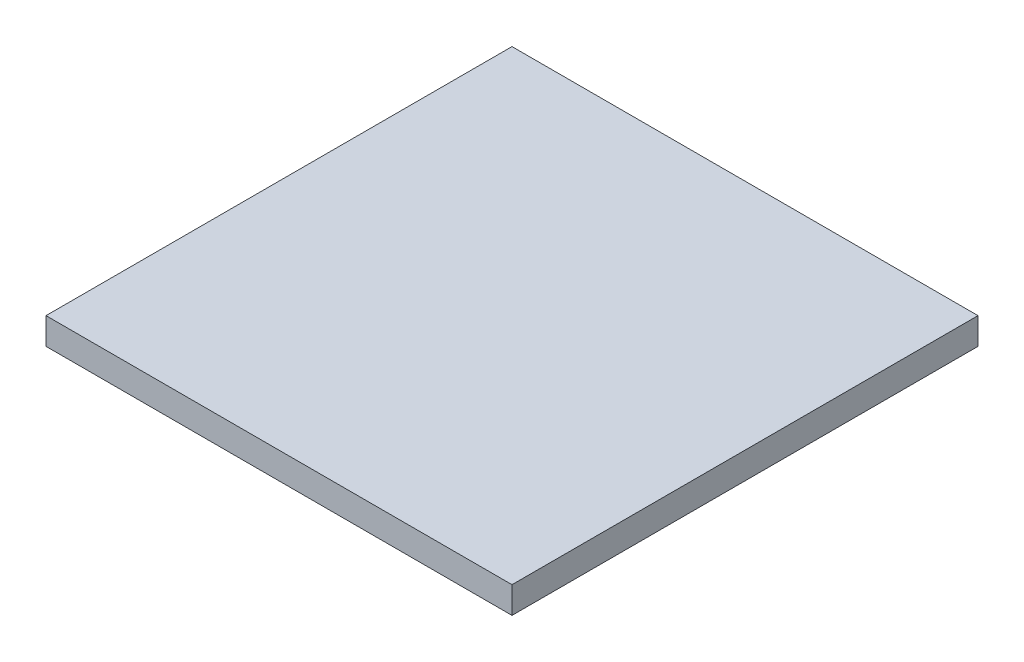
ISO-10303-21;
HEADER;
FILE_DESCRIPTION(('STEP AP214'),'2;1');
FILE_NAME('part.step','',(''),(''),'','','');
FILE_SCHEMA(('AUTOMOTIVE_DESIGN { 1 0 10303 214 1 1 1 1 }'));
ENDSEC;
DATA;
#1=APPLICATION_CONTEXT('core data for automotive mechanical design processes');
#2=APPLICATION_PROTOCOL_DEFINITION('international standard','automotive_design',2000,#1);
#3=PRODUCT_CONTEXT('',#1,'mechanical');
#4=PRODUCT('Part','Part','',(#3));
#5=PRODUCT_RELATED_PRODUCT_CATEGORY('part','',(#4));
#6=PRODUCT_DEFINITION_FORMATION('','',#4);
#7=PRODUCT_DEFINITION_CONTEXT('part definition',#1,'design');
#8=PRODUCT_DEFINITION('design','',#6,#7);
#9=PRODUCT_DEFINITION_SHAPE('','',#8);
#10=(LENGTH_UNIT() NAMED_UNIT(*) SI_UNIT(.MILLI.,.METRE.));
#11=(NAMED_UNIT(*) PLANE_ANGLE_UNIT() SI_UNIT($,.RADIAN.));
#12=(NAMED_UNIT(*) SI_UNIT($,.STERADIAN.) SOLID_ANGLE_UNIT());
#13=UNCERTAINTY_MEASURE_WITH_UNIT(LENGTH_MEASURE(1.E-05),#10,'distance_accuracy_value','');
#14=(GEOMETRIC_REPRESENTATION_CONTEXT(3) GLOBAL_UNCERTAINTY_ASSIGNED_CONTEXT((#13)) GLOBAL_UNIT_ASSIGNED_CONTEXT((#10,
#11,#12)) REPRESENTATION_CONTEXT('',''));
#15=CARTESIAN_POINT('',(0.,0.,0.));
#16=DIRECTION('',(0.,0.,1.));
#17=DIRECTION('',(1.,0.,0.));
#18=AXIS2_PLACEMENT_3D('',#15,#16,#17);
#19=CARTESIAN_POINT('',(-3.5,0.4,-3.5));
#20=DIRECTION('',(1.,0.,0.));
#21=DIRECTION('',(0.,0.,-1.));
#22=AXIS2_PLACEMENT_3D('',#19,#20,#21);
#23=PLANE('',#22);
#24=DIRECTION('',(0.,0.,1.));
#25=VECTOR('',#24,1.);
#26=CARTESIAN_POINT('',(-3.5,0.,-3.5));
#27=LINE('',#26,#25);
#28=CARTESIAN_POINT('',(-3.5,0.,-3.5));
#29=VERTEX_POINT('',#28);
#30=CARTESIAN_POINT('',(-3.5,0.,3.5));
#31=VERTEX_POINT('',#30);
#32=EDGE_CURVE('E110',#29,#31,#27,.T.);
#33=ORIENTED_EDGE('',*,*,#32,.T.);
#34=DIRECTION('',(0.,-1.,0.));
#35=VECTOR('',#34,1.);
#36=CARTESIAN_POINT('',(-3.5,0.4,3.5));
#37=LINE('',#36,#35);
#38=CARTESIAN_POINT('',(-3.5,0.4,3.5));
#39=VERTEX_POINT('',#38);
#40=EDGE_CURVE('E11',#39,#31,#37,.T.);
#41=ORIENTED_EDGE('',*,*,#40,.F.);
#42=DIRECTION('',(0.,0.,1.));
#43=VECTOR('',#42,1.);
#44=CARTESIAN_POINT('',(-3.5,0.4,-3.5));
#45=LINE('',#44,#43);
#46=CARTESIAN_POINT('',(-3.5,0.4,-3.5));
#47=VERTEX_POINT('',#46);
#48=EDGE_CURVE('E93',#47,#39,#45,.T.);
#49=ORIENTED_EDGE('',*,*,#48,.F.);
#50=DIRECTION('',(0.,-1.,0.));
#51=VECTOR('',#50,1.);
#52=CARTESIAN_POINT('',(-3.5,0.4,-3.5));
#53=LINE('',#52,#51);
#54=EDGE_CURVE('E106',#47,#29,#53,.T.);
#55=ORIENTED_EDGE('',*,*,#54,.T.);
#56=EDGE_LOOP('',(#33,#41,#49,#55));
#57=FACE_BOUND('',#56,.T.);
#58=ADVANCED_FACE('F41',(#57),#23,.F.);
#59=CARTESIAN_POINT('',(-3.5,0.4,3.5));
#60=DIRECTION('',(0.,0.,-1.));
#61=DIRECTION('',(-1.,0.,0.));
#62=AXIS2_PLACEMENT_3D('',#59,#60,#61);
#63=PLANE('',#62);
#64=DIRECTION('',(1.,0.,0.));
#65=VECTOR('',#64,1.);
#66=CARTESIAN_POINT('',(-3.5,0.,3.5));
#67=LINE('',#66,#65);
#68=CARTESIAN_POINT('',(3.5,0.,3.5));
#69=VERTEX_POINT('',#68);
#70=EDGE_CURVE('E98',#31,#69,#67,.T.);
#71=ORIENTED_EDGE('',*,*,#70,.T.);
#72=DIRECTION('',(0.,-1.,0.));
#73=VECTOR('',#72,1.);
#74=CARTESIAN_POINT('',(3.5,0.4,3.5));
#75=LINE('',#74,#73);
#76=CARTESIAN_POINT('',(3.5,0.4,3.5));
#77=VERTEX_POINT('',#76);
#78=EDGE_CURVE('E50',#77,#69,#75,.T.);
#79=ORIENTED_EDGE('',*,*,#78,.F.);
#80=DIRECTION('',(1.,0.,0.));
#81=VECTOR('',#80,1.);
#82=CARTESIAN_POINT('',(-3.5,0.4,3.5));
#83=LINE('',#82,#81);
#84=EDGE_CURVE('E88',#39,#77,#83,.T.);
#85=ORIENTED_EDGE('',*,*,#84,.F.);
#86=ORIENTED_EDGE('',*,*,#40,.T.);
#87=EDGE_LOOP('',(#71,#79,#85,#86));
#88=FACE_BOUND('',#87,.T.);
#89=ADVANCED_FACE('F97',(#88),#63,.F.);
#90=CARTESIAN_POINT('',(3.5,0.4,-3.5));
#91=DIRECTION('',(-1.,0.,0.));
#92=DIRECTION('',(0.,0.,1.));
#93=AXIS2_PLACEMENT_3D('',#90,#91,#92);
#94=PLANE('',#93);
#95=DIRECTION('',(0.,0.,-1.));
#96=VECTOR('',#95,1.);
#97=CARTESIAN_POINT('',(3.5,0.,-3.5));
#98=LINE('',#97,#96);
#99=CARTESIAN_POINT('',(3.5,0.,-3.5));
#100=VERTEX_POINT('',#99);
#101=EDGE_CURVE('E75',#69,#100,#98,.T.);
#102=ORIENTED_EDGE('',*,*,#101,.T.);
#103=DIRECTION('',(0.,-1.,0.));
#104=VECTOR('',#103,1.);
#105=CARTESIAN_POINT('',(3.5,0.4,-3.5));
#106=LINE('',#105,#104);
#107=CARTESIAN_POINT('',(3.5,0.4,-3.5));
#108=VERTEX_POINT('',#107);
#109=EDGE_CURVE('E100',#108,#100,#106,.T.);
#110=ORIENTED_EDGE('',*,*,#109,.F.);
#111=DIRECTION('',(0.,0.,-1.));
#112=VECTOR('',#111,1.);
#113=CARTESIAN_POINT('',(3.5,0.4,-3.5));
#114=LINE('',#113,#112);
#115=EDGE_CURVE('E91',#77,#108,#114,.T.);
#116=ORIENTED_EDGE('',*,*,#115,.F.);
#117=ORIENTED_EDGE('',*,*,#78,.T.);
#118=EDGE_LOOP('',(#102,#110,#116,#117));
#119=FACE_BOUND('',#118,.T.);
#120=ADVANCED_FACE('F101',(#119),#94,.F.);
#121=CARTESIAN_POINT('',(-3.5,0.4,-3.5));
#122=DIRECTION('',(0.,0.,1.));
#123=DIRECTION('',(1.,0.,0.));
#124=AXIS2_PLACEMENT_3D('',#121,#122,#123);
#125=PLANE('',#124);
#126=DIRECTION('',(-1.,0.,0.));
#127=VECTOR('',#126,1.);
#128=CARTESIAN_POINT('',(-3.5,0.,-3.5));
#129=LINE('',#128,#127);
#130=EDGE_CURVE('E81',#100,#29,#129,.T.);
#131=ORIENTED_EDGE('',*,*,#130,.T.);
#132=ORIENTED_EDGE('',*,*,#54,.F.);
#133=DIRECTION('',(-1.,0.,0.));
#134=VECTOR('',#133,1.);
#135=CARTESIAN_POINT('',(-3.5,0.4,-3.5));
#136=LINE('',#135,#134);
#137=EDGE_CURVE('E58',#108,#47,#136,.T.);
#138=ORIENTED_EDGE('',*,*,#137,.F.);
#139=ORIENTED_EDGE('',*,*,#109,.T.);
#140=EDGE_LOOP('',(#131,#132,#138,#139));
#141=FACE_BOUND('',#140,.T.);
#142=ADVANCED_FACE('F122',(#141),#125,.F.);
#143=CARTESIAN_POINT('',(0.,0.4,0.));
#144=DIRECTION('',(0.,1.,0.));
#145=DIRECTION('',(0.,0.,1.));
#146=AXIS2_PLACEMENT_3D('',#143,#144,#145);
#147=PLANE('',#146);
#148=ORIENTED_EDGE('',*,*,#48,.T.);
#149=ORIENTED_EDGE('',*,*,#84,.T.);
#150=ORIENTED_EDGE('',*,*,#115,.T.);
#151=ORIENTED_EDGE('',*,*,#137,.T.);
#152=EDGE_LOOP('',(#148,#149,#150,#151));
#153=FACE_BOUND('',#152,.T.);
#154=ADVANCED_FACE('F89',(#153),#147,.T.);
#155=CARTESIAN_POINT('',(0.,0.,0.));
#156=DIRECTION('',(0.,1.,0.));
#157=DIRECTION('',(0.,0.,1.));
#158=AXIS2_PLACEMENT_3D('',#155,#156,#157);
#159=PLANE('',#158);
#160=ORIENTED_EDGE('',*,*,#32,.F.);
#161=ORIENTED_EDGE('',*,*,#130,.F.);
#162=ORIENTED_EDGE('',*,*,#101,.F.);
#163=ORIENTED_EDGE('',*,*,#70,.F.);
#164=EDGE_LOOP('',(#160,#161,#162,#163));
#165=FACE_BOUND('',#164,.T.);
#166=ADVANCED_FACE('F125',(#165),#159,.F.);
#167=CLOSED_SHELL('',(#58,#89,#120,#142,#154,#166));
#168=MANIFOLD_SOLID_BREP('B2',#167);
#169=ADVANCED_BREP_SHAPE_REPRESENTATION('',(#18,#168),#14);
#170=SHAPE_DEFINITION_REPRESENTATION(#9,#169);
ENDSEC;
END-ISO-10303-21;
